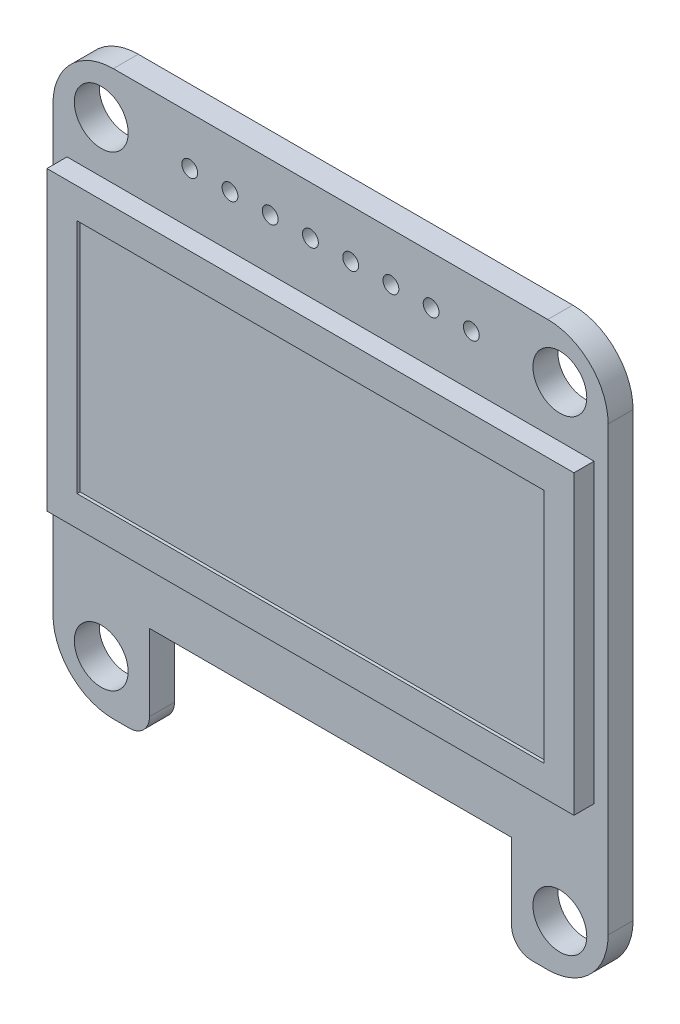
ISO-10303-21;
HEADER;
FILE_DESCRIPTION(('STEP AP214'),'2;1');
FILE_NAME('part.step','',(''),(''),'','','');
FILE_SCHEMA(('AUTOMOTIVE_DESIGN { 1 0 10303 214 1 1 1 1 }'));
ENDSEC;
DATA;
#1=APPLICATION_CONTEXT('core data for automotive mechanical design processes');
#2=APPLICATION_PROTOCOL_DEFINITION('international standard','automotive_design',2000,#1);
#3=PRODUCT_CONTEXT('',#1,'mechanical');
#4=PRODUCT('Part','Part','',(#3));
#5=PRODUCT_RELATED_PRODUCT_CATEGORY('part','',(#4));
#6=PRODUCT_DEFINITION_FORMATION('','',#4);
#7=PRODUCT_DEFINITION_CONTEXT('part definition',#1,'design');
#8=PRODUCT_DEFINITION('design','',#6,#7);
#9=PRODUCT_DEFINITION_SHAPE('','',#8);
#10=(LENGTH_UNIT() NAMED_UNIT(*) SI_UNIT(.MILLI.,.METRE.));
#11=(NAMED_UNIT(*) PLANE_ANGLE_UNIT() SI_UNIT($,.RADIAN.));
#12=(NAMED_UNIT(*) SI_UNIT($,.STERADIAN.) SOLID_ANGLE_UNIT());
#13=UNCERTAINTY_MEASURE_WITH_UNIT(LENGTH_MEASURE(1.E-05),#10,'distance_accuracy_value','');
#14=(GEOMETRIC_REPRESENTATION_CONTEXT(3) GLOBAL_UNCERTAINTY_ASSIGNED_CONTEXT((#13)) GLOBAL_UNIT_ASSIGNED_CONTEXT((#10,
#11,#12)) REPRESENTATION_CONTEXT('',''));
#15=CARTESIAN_POINT('',(0.,0.,0.));
#16=DIRECTION('',(0.,0.,1.));
#17=DIRECTION('',(1.,0.,0.));
#18=AXIS2_PLACEMENT_3D('',#15,#16,#17);
#19=CARTESIAN_POINT('',(-3.048,-3.048,1.5748));
#20=DIRECTION('',(0.,1.,0.));
#21=DIRECTION('',(0.,0.,1.));
#22=AXIS2_PLACEMENT_3D('',#19,#20,#21);
#23=PLANE('',#22);
#24=DIRECTION('',(1.,0.,0.));
#25=VECTOR('',#24,1.);
#26=CARTESIAN_POINT('',(-3.048,-3.048,0.));
#27=LINE('',#26,#25);
#28=CARTESIAN_POINT('',(0.762000000000003,-3.048,0.));
#29=VERTEX_POINT('',#28);
#30=CARTESIAN_POINT('',(1.778,-3.048,0.));
#31=VERTEX_POINT('',#30);
#32=EDGE_CURVE('E370',#29,#31,#27,.T.);
#33=ORIENTED_EDGE('',*,*,#32,.T.);
#34=DIRECTION('',(0.,0.,1.));
#35=VECTOR('',#34,1.);
#36=CARTESIAN_POINT('',(1.778,-3.048,1.5748));
#37=LINE('',#36,#35);
#38=CARTESIAN_POINT('',(1.778,-3.048,1.5748));
#39=VERTEX_POINT('',#38);
#40=EDGE_CURVE('E412',#31,#39,#37,.T.);
#41=ORIENTED_EDGE('',*,*,#40,.T.);
#42=DIRECTION('',(1.,0.,0.));
#43=VECTOR('',#42,1.);
#44=CARTESIAN_POINT('',(-3.048,-3.048,1.5748));
#45=LINE('',#44,#43);
#46=CARTESIAN_POINT('',(0.762000000000003,-3.048,1.5748));
#47=VERTEX_POINT('',#46);
#48=EDGE_CURVE('E357',#47,#39,#45,.T.);
#49=ORIENTED_EDGE('',*,*,#48,.F.);
#50=DIRECTION('',(0.,0.,-1.));
#51=VECTOR('',#50,1.);
#52=CARTESIAN_POINT('',(0.762000000000003,-3.048,1.5748));
#53=LINE('',#52,#51);
#54=EDGE_CURVE('E363',#47,#29,#53,.T.);
#55=ORIENTED_EDGE('',*,*,#54,.T.);
#56=EDGE_LOOP('',(#33,#41,#49,#55));
#57=FACE_BOUND('',#56,.T.);
#58=ADVANCED_FACE('F41',(#57),#23,.F.);
#59=CARTESIAN_POINT('',(-3.048,32.512,1.5748));
#60=DIRECTION('',(0.,1.,0.));
#61=DIRECTION('',(0.,0.,1.));
#62=AXIS2_PLACEMENT_3D('',#59,#60,#61);
#63=PLANE('',#62);
#64=DIRECTION('',(1.,0.,0.));
#65=VECTOR('',#64,1.);
#66=CARTESIAN_POINT('',(-3.048,32.512,1.5748));
#67=LINE('',#66,#65);
#68=CARTESIAN_POINT('',(0.762,32.512,1.5748));
#69=VERTEX_POINT('',#68);
#70=CARTESIAN_POINT('',(28.194,32.512,1.5748));
#71=VERTEX_POINT('',#70);
#72=EDGE_CURVE('E349',#69,#71,#67,.T.);
#73=ORIENTED_EDGE('',*,*,#72,.T.);
#74=DIRECTION('',(0.,0.,-1.));
#75=VECTOR('',#74,1.);
#76=CARTESIAN_POINT('',(28.194,32.512,1.5748));
#77=LINE('',#76,#75);
#78=CARTESIAN_POINT('',(28.194,32.512,0.));
#79=VERTEX_POINT('',#78);
#80=EDGE_CURVE('E409',#71,#79,#77,.T.);
#81=ORIENTED_EDGE('',*,*,#80,.T.);
#82=DIRECTION('',(1.,0.,0.));
#83=VECTOR('',#82,1.);
#84=CARTESIAN_POINT('',(-3.048,32.512,0.));
#85=LINE('',#84,#83);
#86=CARTESIAN_POINT('',(0.762,32.512,0.));
#87=VERTEX_POINT('',#86);
#88=EDGE_CURVE('E346',#87,#79,#85,.T.);
#89=ORIENTED_EDGE('',*,*,#88,.F.);
#90=DIRECTION('',(0.,0.,-1.));
#91=VECTOR('',#90,1.);
#92=CARTESIAN_POINT('',(0.762,32.512,1.5748));
#93=LINE('',#92,#91);
#94=EDGE_CURVE('E407',#87,#69,#93,.F.);
#95=ORIENTED_EDGE('',*,*,#94,.T.);
#96=EDGE_LOOP('',(#73,#81,#89,#95));
#97=FACE_BOUND('',#96,.T.);
#98=ADVANCED_FACE('F467',(#97),#63,.T.);
#99=CARTESIAN_POINT('',(-3.048,32.512,1.5748));
#100=DIRECTION('',(1.,0.,0.));
#101=DIRECTION('',(0.,1.,0.));
#102=AXIS2_PLACEMENT_3D('',#99,#100,#101);
#103=PLANE('',#102);
#104=DIRECTION('',(0.,-1.,0.));
#105=VECTOR('',#104,1.);
#106=CARTESIAN_POINT('',(-3.048,32.512,0.));
#107=LINE('',#106,#105);
#108=CARTESIAN_POINT('',(-3.048,28.702,0.));
#109=VERTEX_POINT('',#108);
#110=CARTESIAN_POINT('',(-3.048,0.762000000000006,0.));
#111=VERTEX_POINT('',#110);
#112=EDGE_CURVE('E353',#109,#111,#107,.T.);
#113=ORIENTED_EDGE('',*,*,#112,.T.);
#114=DIRECTION('',(0.,0.,-1.));
#115=VECTOR('',#114,1.);
#116=CARTESIAN_POINT('',(-3.048,0.762000000000006,1.5748));
#117=LINE('',#116,#115);
#118=CARTESIAN_POINT('',(-3.048,0.762000000000006,1.5748));
#119=VERTEX_POINT('',#118);
#120=EDGE_CURVE('E389',#111,#119,#117,.F.);
#121=ORIENTED_EDGE('',*,*,#120,.T.);
#122=DIRECTION('',(0.,-1.,0.));
#123=VECTOR('',#122,1.);
#124=CARTESIAN_POINT('',(-3.048,32.512,1.5748));
#125=LINE('',#124,#123);
#126=CARTESIAN_POINT('',(-3.048,28.702,1.5748));
#127=VERTEX_POINT('',#126);
#128=EDGE_CURVE('E360',#127,#119,#125,.T.);
#129=ORIENTED_EDGE('',*,*,#128,.F.);
#130=DIRECTION('',(0.,0.,-1.));
#131=VECTOR('',#130,1.);
#132=CARTESIAN_POINT('',(-3.048,28.702,0.));
#133=LINE('',#132,#131);
#134=EDGE_CURVE('E386',#127,#109,#133,.T.);
#135=ORIENTED_EDGE('',*,*,#134,.T.);
#136=EDGE_LOOP('',(#113,#121,#129,#135));
#137=FACE_BOUND('',#136,.T.);
#138=ADVANCED_FACE('F476',(#137),#103,.F.);
#139=CARTESIAN_POINT('',(27.178,-3.048,1.5748));
#140=VERTEX_POINT('',#139);
#141=CARTESIAN_POINT('',(28.194,-3.048,1.5748));
#142=VERTEX_POINT('',#141);
#143=EDGE_CURVE('E356',#140,#142,#45,.T.);
#144=ORIENTED_EDGE('',*,*,#143,.F.);
#145=DIRECTION('',(0.,0.,1.));
#146=VECTOR('',#145,1.);
#147=CARTESIAN_POINT('',(27.178,-3.048,1.5748));
#148=LINE('',#147,#146);
#149=CARTESIAN_POINT('',(27.178,-3.048,0.));
#150=VERTEX_POINT('',#149);
#151=EDGE_CURVE('E11',#140,#150,#148,.F.);
#152=ORIENTED_EDGE('',*,*,#151,.T.);
#153=CARTESIAN_POINT('',(28.194,-3.048,0.));
#154=VERTEX_POINT('',#153);
#155=EDGE_CURVE('E369',#150,#154,#27,.T.);
#156=ORIENTED_EDGE('',*,*,#155,.T.);
#157=DIRECTION('',(0.,0.,-1.));
#158=VECTOR('',#157,1.);
#159=CARTESIAN_POINT('',(28.194,-3.048,1.5748));
#160=LINE('',#159,#158);
#161=EDGE_CURVE('E404',#154,#142,#160,.F.);
#162=ORIENTED_EDGE('',*,*,#161,.T.);
#163=EDGE_LOOP('',(#144,#152,#156,#162));
#164=FACE_BOUND('',#163,.T.);
#165=ADVANCED_FACE('F449',(#164),#23,.F.);
#166=CARTESIAN_POINT('',(32.004,32.512,1.5748));
#167=DIRECTION('',(1.,0.,0.));
#168=DIRECTION('',(0.,0.,-1.));
#169=AXIS2_PLACEMENT_3D('',#166,#167,#168);
#170=PLANE('',#169);
#171=DIRECTION('',(0.,-1.,0.));
#172=VECTOR('',#171,1.);
#173=CARTESIAN_POINT('',(32.004,32.512,1.5748));
#174=LINE('',#173,#172);
#175=CARTESIAN_POINT('',(32.004,28.702,1.5748));
#176=VERTEX_POINT('',#175);
#177=CARTESIAN_POINT('',(32.004,0.762000000000006,1.5748));
#178=VERTEX_POINT('',#177);
#179=EDGE_CURVE('E352',#176,#178,#174,.T.);
#180=ORIENTED_EDGE('',*,*,#179,.T.);
#181=DIRECTION('',(0.,0.,-1.));
#182=VECTOR('',#181,1.);
#183=CARTESIAN_POINT('',(32.004,0.762000000000006,0.));
#184=LINE('',#183,#182);
#185=CARTESIAN_POINT('',(32.004,0.762000000000006,0.));
#186=VERTEX_POINT('',#185);
#187=EDGE_CURVE('E401',#178,#186,#184,.T.);
#188=ORIENTED_EDGE('',*,*,#187,.T.);
#189=DIRECTION('',(0.,-1.,0.));
#190=VECTOR('',#189,1.);
#191=CARTESIAN_POINT('',(32.004,32.512,0.));
#192=LINE('',#191,#190);
#193=CARTESIAN_POINT('',(32.004,28.702,0.));
#194=VERTEX_POINT('',#193);
#195=EDGE_CURVE('E366',#194,#186,#192,.T.);
#196=ORIENTED_EDGE('',*,*,#195,.F.);
#197=DIRECTION('',(0.,0.,-1.));
#198=VECTOR('',#197,1.);
#199=CARTESIAN_POINT('',(32.004,28.702,1.5748));
#200=LINE('',#199,#198);
#201=EDGE_CURVE('E399',#194,#176,#200,.F.);
#202=ORIENTED_EDGE('',*,*,#201,.T.);
#203=EDGE_LOOP('',(#180,#188,#196,#202));
#204=FACE_BOUND('',#203,.T.);
#205=ADVANCED_FACE('F457',(#204),#170,.T.);
#206=CARTESIAN_POINT('',(0.,0.,1.5748));
#207=DIRECTION('',(0.,0.,-1.));
#208=DIRECTION('',(-1.,0.,0.));
#209=AXIS2_PLACEMENT_3D('',#206,#207,#208);
#210=PLANE('',#209);
#211=DIRECTION('',(-1.,0.,0.));
#212=VECTOR('',#211,1.);
#213=CARTESIAN_POINT('',(31.115,26.2240568461912,1.5748));
#214=LINE('',#213,#212);
#215=CARTESIAN_POINT('',(31.115,26.2240568461912,1.5748));
#216=VERTEX_POINT('',#215);
#217=CARTESIAN_POINT('',(-2.15899999999999,26.2240568461912,1.5748));
#218=VERTEX_POINT('',#217);
#219=EDGE_CURVE('E234',#216,#218,#214,.T.);
#220=ORIENTED_EDGE('',*,*,#219,.F.);
#221=DIRECTION('',(0.,-1.,0.));
#222=VECTOR('',#221,1.);
#223=CARTESIAN_POINT('',(31.115,26.2240568461912,1.5748));
#224=LINE('',#223,#222);
#225=CARTESIAN_POINT('',(31.115,7.49300000000001,1.5748));
#226=VERTEX_POINT('',#225);
#227=EDGE_CURVE('E226',#216,#226,#224,.T.);
#228=ORIENTED_EDGE('',*,*,#227,.T.);
#229=DIRECTION('',(-1.,0.,0.));
#230=VECTOR('',#229,1.);
#231=CARTESIAN_POINT('',(31.115,7.49300000000001,1.5748));
#232=LINE('',#231,#230);
#233=CARTESIAN_POINT('',(-2.15899999999999,7.493,1.5748));
#234=VERTEX_POINT('',#233);
#235=EDGE_CURVE('E244',#226,#234,#232,.T.);
#236=ORIENTED_EDGE('',*,*,#235,.T.);
#237=DIRECTION('',(0.,-1.,0.));
#238=VECTOR('',#237,1.);
#239=CARTESIAN_POINT('',(-2.15899999999999,26.2240568461912,1.5748));
#240=LINE('',#239,#238);
#241=EDGE_CURVE('E64',#218,#234,#240,.T.);
#242=ORIENTED_EDGE('',*,*,#241,.F.);
#243=EDGE_LOOP('',(#220,#228,#236,#242));
#244=FACE_BOUND('',#243,.T.);
#245=CARTESIAN_POINT('',(5.58799999999999,29.464,1.5748));
#246=DIRECTION('',(0.,0.,1.));
#247=DIRECTION('',(1.,0.,0.));
#248=AXIS2_PLACEMENT_3D('',#245,#246,#247);
#249=CIRCLE('',#248,0.5);
#250=CARTESIAN_POINT('',(6.08799999999999,29.464,1.5748));
#251=VERTEX_POINT('',#250);
#252=EDGE_CURVE('E251',#251,#251,#249,.T.);
#253=ORIENTED_EDGE('',*,*,#252,.F.);
#254=EDGE_LOOP('',(#253));
#255=FACE_BOUND('',#254,.T.);
#256=CARTESIAN_POINT('',(8.12799999999999,29.464,1.5748));
#257=DIRECTION('',(0.,0.,1.));
#258=DIRECTION('',(1.,0.,0.));
#259=AXIS2_PLACEMENT_3D('',#256,#257,#258);
#260=CIRCLE('',#259,0.5);
#261=CARTESIAN_POINT('',(8.62799999999999,29.464,1.5748));
#262=VERTEX_POINT('',#261);
#263=EDGE_CURVE('E262',#262,#262,#260,.T.);
#264=ORIENTED_EDGE('',*,*,#263,.F.);
#265=EDGE_LOOP('',(#264));
#266=FACE_BOUND('',#265,.T.);
#267=CARTESIAN_POINT('',(10.668,29.464,1.5748));
#268=DIRECTION('',(0.,0.,1.));
#269=DIRECTION('',(1.,0.,0.));
#270=AXIS2_PLACEMENT_3D('',#267,#268,#269);
#271=CIRCLE('',#270,0.5);
#272=CARTESIAN_POINT('',(11.168,29.464,1.5748));
#273=VERTEX_POINT('',#272);
#274=EDGE_CURVE('E268',#273,#273,#271,.T.);
#275=ORIENTED_EDGE('',*,*,#274,.F.);
#276=EDGE_LOOP('',(#275));
#277=FACE_BOUND('',#276,.T.);
#278=CARTESIAN_POINT('',(13.208,29.464,1.5748));
#279=DIRECTION('',(0.,0.,1.));
#280=DIRECTION('',(1.,0.,0.));
#281=AXIS2_PLACEMENT_3D('',#278,#279,#280);
#282=CIRCLE('',#281,0.5);
#283=CARTESIAN_POINT('',(13.708,29.464,1.5748));
#284=VERTEX_POINT('',#283);
#285=EDGE_CURVE('E274',#284,#284,#282,.T.);
#286=ORIENTED_EDGE('',*,*,#285,.F.);
#287=EDGE_LOOP('',(#286));
#288=FACE_BOUND('',#287,.T.);
#289=CARTESIAN_POINT('',(15.748,29.464,1.5748));
#290=DIRECTION('',(0.,0.,1.));
#291=DIRECTION('',(1.,0.,0.));
#292=AXIS2_PLACEMENT_3D('',#289,#290,#291);
#293=CIRCLE('',#292,0.5);
#294=CARTESIAN_POINT('',(16.248,29.464,1.5748));
#295=VERTEX_POINT('',#294);
#296=EDGE_CURVE('E280',#295,#295,#293,.T.);
#297=ORIENTED_EDGE('',*,*,#296,.F.);
#298=EDGE_LOOP('',(#297));
#299=FACE_BOUND('',#298,.T.);
#300=CARTESIAN_POINT('',(18.288,29.464,1.5748));
#301=DIRECTION('',(0.,0.,1.));
#302=DIRECTION('',(1.,0.,0.));
#303=AXIS2_PLACEMENT_3D('',#300,#301,#302);
#304=CIRCLE('',#303,0.5);
#305=CARTESIAN_POINT('',(18.788,29.464,1.5748));
#306=VERTEX_POINT('',#305);
#307=EDGE_CURVE('E286',#306,#306,#304,.T.);
#308=ORIENTED_EDGE('',*,*,#307,.F.);
#309=EDGE_LOOP('',(#308));
#310=FACE_BOUND('',#309,.T.);
#311=CARTESIAN_POINT('',(20.828,29.464,1.5748));
#312=DIRECTION('',(0.,0.,1.));
#313=DIRECTION('',(1.,0.,0.));
#314=AXIS2_PLACEMENT_3D('',#311,#312,#313);
#315=CIRCLE('',#314,0.5);
#316=CARTESIAN_POINT('',(21.328,29.464,1.5748));
#317=VERTEX_POINT('',#316);
#318=EDGE_CURVE('E292',#317,#317,#315,.T.);
#319=ORIENTED_EDGE('',*,*,#318,.F.);
#320=EDGE_LOOP('',(#319));
#321=FACE_BOUND('',#320,.T.);
#322=CARTESIAN_POINT('',(23.368,29.464,1.5748));
#323=DIRECTION('',(0.,0.,1.));
#324=DIRECTION('',(1.,0.,0.));
#325=AXIS2_PLACEMENT_3D('',#322,#323,#324);
#326=CIRCLE('',#325,0.5);
#327=CARTESIAN_POINT('',(23.868,29.464,1.5748));
#328=VERTEX_POINT('',#327);
#329=EDGE_CURVE('E298',#328,#328,#326,.T.);
#330=ORIENTED_EDGE('',*,*,#329,.F.);
#331=EDGE_LOOP('',(#330));
#332=FACE_BOUND('',#331,.T.);
#333=CARTESIAN_POINT('',(0.,29.464,1.5748));
#334=DIRECTION('',(0.,0.,1.));
#335=DIRECTION('',(1.,0.,0.));
#336=AXIS2_PLACEMENT_3D('',#333,#334,#335);
#337=CIRCLE('',#336,1.69999999999999);
#338=CARTESIAN_POINT('',(1.69999999999999,29.464,1.5748));
#339=VERTEX_POINT('',#338);
#340=EDGE_CURVE('E304',#339,#339,#337,.T.);
#341=ORIENTED_EDGE('',*,*,#340,.F.);
#342=EDGE_LOOP('',(#341));
#343=FACE_BOUND('',#342,.T.);
#344=CARTESIAN_POINT('',(0.,0.,1.5748));
#345=DIRECTION('',(0.,0.,1.));
#346=DIRECTION('',(1.,0.,0.));
#347=AXIS2_PLACEMENT_3D('',#344,#345,#346);
#348=CIRCLE('',#347,1.69999999999999);
#349=CARTESIAN_POINT('',(1.69999999999999,0.,1.5748));
#350=VERTEX_POINT('',#349);
#351=EDGE_CURVE('E310',#350,#350,#348,.T.);
#352=ORIENTED_EDGE('',*,*,#351,.F.);
#353=EDGE_LOOP('',(#352));
#354=FACE_BOUND('',#353,.T.);
#355=CARTESIAN_POINT('',(28.956,0.,1.5748));
#356=DIRECTION('',(0.,0.,1.));
#357=DIRECTION('',(1.,0.,0.));
#358=AXIS2_PLACEMENT_3D('',#355,#356,#357);
#359=CIRCLE('',#358,1.69999999999999);
#360=CARTESIAN_POINT('',(30.656,0.,1.5748));
#361=VERTEX_POINT('',#360);
#362=EDGE_CURVE('E316',#361,#361,#359,.T.);
#363=ORIENTED_EDGE('',*,*,#362,.F.);
#364=EDGE_LOOP('',(#363));
#365=FACE_BOUND('',#364,.T.);
#366=CARTESIAN_POINT('',(28.956,29.464,1.5748));
#367=DIRECTION('',(0.,0.,1.));
#368=DIRECTION('',(1.,0.,0.));
#369=AXIS2_PLACEMENT_3D('',#366,#367,#368);
#370=CIRCLE('',#369,1.69999999999999);
#371=CARTESIAN_POINT('',(30.656,29.464,1.5748));
#372=VERTEX_POINT('',#371);
#373=EDGE_CURVE('E322',#372,#372,#370,.T.);
#374=ORIENTED_EDGE('',*,*,#373,.F.);
#375=EDGE_LOOP('',(#374));
#376=FACE_BOUND('',#375,.T.);
#377=ORIENTED_EDGE('',*,*,#48,.T.);
#378=CARTESIAN_POINT('',(1.778,-1.778,1.5748));
#379=DIRECTION('',(0.,0.,-1.));
#380=DIRECTION('',(-1.,0.,0.));
#381=AXIS2_PLACEMENT_3D('',#378,#379,#380);
#382=CIRCLE('',#381,1.27);
#383=CARTESIAN_POINT('',(3.048,-1.778,1.5748));
#384=VERTEX_POINT('',#383);
#385=EDGE_CURVE('E417',#39,#384,#382,.F.);
#386=ORIENTED_EDGE('',*,*,#385,.T.);
#387=DIRECTION('',(0.,1.,0.));
#388=VECTOR('',#387,1.);
#389=CARTESIAN_POINT('',(3.048,0.,1.5748));
#390=LINE('',#389,#388);
#391=CARTESIAN_POINT('',(3.048,3.048,1.5748));
#392=VERTEX_POINT('',#391);
#393=EDGE_CURVE('E332',#384,#392,#390,.T.);
#394=ORIENTED_EDGE('',*,*,#393,.T.);
#395=DIRECTION('',(1.,0.,0.));
#396=VECTOR('',#395,1.);
#397=CARTESIAN_POINT('',(0.,3.048,1.5748));
#398=LINE('',#397,#396);
#399=CARTESIAN_POINT('',(25.908,3.048,1.5748));
#400=VERTEX_POINT('',#399);
#401=EDGE_CURVE('E339',#392,#400,#398,.T.);
#402=ORIENTED_EDGE('',*,*,#401,.T.);
#403=DIRECTION('',(0.,1.,0.));
#404=VECTOR('',#403,1.);
#405=CARTESIAN_POINT('',(25.908,0.,1.5748));
#406=LINE('',#405,#404);
#407=CARTESIAN_POINT('',(25.908,-1.778,1.5748));
#408=VERTEX_POINT('',#407);
#409=EDGE_CURVE('E328',#408,#400,#406,.T.);
#410=ORIENTED_EDGE('',*,*,#409,.F.);
#411=CARTESIAN_POINT('',(27.178,-1.778,1.5748));
#412=DIRECTION('',(0.,0.,-1.));
#413=DIRECTION('',(-1.,0.,0.));
#414=AXIS2_PLACEMENT_3D('',#411,#412,#413);
#415=CIRCLE('',#414,1.27);
#416=EDGE_CURVE('E415',#408,#140,#415,.F.);
#417=ORIENTED_EDGE('',*,*,#416,.T.);
#418=ORIENTED_EDGE('',*,*,#143,.T.);
#419=CARTESIAN_POINT('',(28.194,0.762000000000006,1.5748));
#420=DIRECTION('',(0.,0.,-1.));
#421=DIRECTION('',(-1.,0.,0.));
#422=AXIS2_PLACEMENT_3D('',#419,#420,#421);
#423=CIRCLE('',#422,3.81);
#424=EDGE_CURVE('E395',#142,#178,#423,.F.);
#425=ORIENTED_EDGE('',*,*,#424,.T.);
#426=ORIENTED_EDGE('',*,*,#179,.F.);
#427=CARTESIAN_POINT('',(28.194,28.702,1.5748));
#428=DIRECTION('',(0.,0.,-1.));
#429=DIRECTION('',(-1.,0.,0.));
#430=AXIS2_PLACEMENT_3D('',#427,#428,#429);
#431=CIRCLE('',#430,3.81);
#432=EDGE_CURVE('E393',#176,#71,#431,.F.);
#433=ORIENTED_EDGE('',*,*,#432,.T.);
#434=ORIENTED_EDGE('',*,*,#72,.F.);
#435=CARTESIAN_POINT('',(0.762,28.702,1.5748));
#436=DIRECTION('',(0.,0.,-1.));
#437=DIRECTION('',(-1.,0.,0.));
#438=AXIS2_PLACEMENT_3D('',#435,#436,#437);
#439=CIRCLE('',#438,3.81);
#440=EDGE_CURVE('E391',#69,#127,#439,.F.);
#441=ORIENTED_EDGE('',*,*,#440,.T.);
#442=ORIENTED_EDGE('',*,*,#128,.T.);
#443=CARTESIAN_POINT('',(0.762000000000003,0.762000000000004,1.5748));
#444=DIRECTION('',(0.,0.,-1.));
#445=DIRECTION('',(-1.,0.,0.));
#446=AXIS2_PLACEMENT_3D('',#443,#444,#445);
#447=CIRCLE('',#446,3.81);
#448=EDGE_CURVE('E397',#119,#47,#447,.F.);
#449=ORIENTED_EDGE('',*,*,#448,.T.);
#450=EDGE_LOOP('',(#377,#386,#394,#402,#410,#417,#418,#425,#426,#433,#434,#441,#442,#449));
#451=FACE_BOUND('',#450,.T.);
#452=ADVANCED_FACE('F434',(#244,#255,#266,#277,#288,#299,#310,#321,#332,#343,#354,#365,#376,
#451),#210,.F.);
#453=CARTESIAN_POINT('',(0.,0.,0.));
#454=DIRECTION('',(0.,0.,-1.));
#455=DIRECTION('',(-1.,0.,0.));
#456=AXIS2_PLACEMENT_3D('',#453,#454,#455);
#457=PLANE('',#456);
#458=CARTESIAN_POINT('',(5.58799999999999,29.464,0.));
#459=DIRECTION('',(0.,0.,1.));
#460=DIRECTION('',(1.,0.,0.));
#461=AXIS2_PLACEMENT_3D('',#458,#459,#460);
#462=CIRCLE('',#461,0.5);
#463=CARTESIAN_POINT('',(6.08799999999999,29.464,0.));
#464=VERTEX_POINT('',#463);
#465=EDGE_CURVE('E259',#464,#464,#462,.T.);
#466=ORIENTED_EDGE('',*,*,#465,.T.);
#467=EDGE_LOOP('',(#466));
#468=FACE_BOUND('',#467,.T.);
#469=CARTESIAN_POINT('',(8.12799999999999,29.464,0.));
#470=DIRECTION('',(0.,0.,1.));
#471=DIRECTION('',(1.,0.,0.));
#472=AXIS2_PLACEMENT_3D('',#469,#470,#471);
#473=CIRCLE('',#472,0.5);
#474=CARTESIAN_POINT('',(8.62799999999999,29.464,0.));
#475=VERTEX_POINT('',#474);
#476=EDGE_CURVE('E265',#475,#475,#473,.T.);
#477=ORIENTED_EDGE('',*,*,#476,.T.);
#478=EDGE_LOOP('',(#477));
#479=FACE_BOUND('',#478,.T.);
#480=CARTESIAN_POINT('',(10.668,29.464,0.));
#481=DIRECTION('',(0.,0.,1.));
#482=DIRECTION('',(1.,0.,0.));
#483=AXIS2_PLACEMENT_3D('',#480,#481,#482);
#484=CIRCLE('',#483,0.5);
#485=CARTESIAN_POINT('',(11.168,29.464,0.));
#486=VERTEX_POINT('',#485);
#487=EDGE_CURVE('E271',#486,#486,#484,.T.);
#488=ORIENTED_EDGE('',*,*,#487,.T.);
#489=EDGE_LOOP('',(#488));
#490=FACE_BOUND('',#489,.T.);
#491=CARTESIAN_POINT('',(13.208,29.464,0.));
#492=DIRECTION('',(0.,0.,1.));
#493=DIRECTION('',(1.,0.,0.));
#494=AXIS2_PLACEMENT_3D('',#491,#492,#493);
#495=CIRCLE('',#494,0.5);
#496=CARTESIAN_POINT('',(13.708,29.464,0.));
#497=VERTEX_POINT('',#496);
#498=EDGE_CURVE('E277',#497,#497,#495,.T.);
#499=ORIENTED_EDGE('',*,*,#498,.T.);
#500=EDGE_LOOP('',(#499));
#501=FACE_BOUND('',#500,.T.);
#502=CARTESIAN_POINT('',(15.748,29.464,0.));
#503=DIRECTION('',(0.,0.,1.));
#504=DIRECTION('',(1.,0.,0.));
#505=AXIS2_PLACEMENT_3D('',#502,#503,#504);
#506=CIRCLE('',#505,0.5);
#507=CARTESIAN_POINT('',(16.248,29.464,0.));
#508=VERTEX_POINT('',#507);
#509=EDGE_CURVE('E283',#508,#508,#506,.T.);
#510=ORIENTED_EDGE('',*,*,#509,.T.);
#511=EDGE_LOOP('',(#510));
#512=FACE_BOUND('',#511,.T.);
#513=CARTESIAN_POINT('',(18.288,29.464,0.));
#514=DIRECTION('',(0.,0.,1.));
#515=DIRECTION('',(1.,0.,0.));
#516=AXIS2_PLACEMENT_3D('',#513,#514,#515);
#517=CIRCLE('',#516,0.5);
#518=CARTESIAN_POINT('',(18.788,29.464,0.));
#519=VERTEX_POINT('',#518);
#520=EDGE_CURVE('E289',#519,#519,#517,.T.);
#521=ORIENTED_EDGE('',*,*,#520,.T.);
#522=EDGE_LOOP('',(#521));
#523=FACE_BOUND('',#522,.T.);
#524=CARTESIAN_POINT('',(20.828,29.464,0.));
#525=DIRECTION('',(0.,0.,1.));
#526=DIRECTION('',(1.,0.,0.));
#527=AXIS2_PLACEMENT_3D('',#524,#525,#526);
#528=CIRCLE('',#527,0.5);
#529=CARTESIAN_POINT('',(21.328,29.464,0.));
#530=VERTEX_POINT('',#529);
#531=EDGE_CURVE('E295',#530,#530,#528,.T.);
#532=ORIENTED_EDGE('',*,*,#531,.T.);
#533=EDGE_LOOP('',(#532));
#534=FACE_BOUND('',#533,.T.);
#535=CARTESIAN_POINT('',(23.368,29.464,0.));
#536=DIRECTION('',(0.,0.,1.));
#537=DIRECTION('',(1.,0.,0.));
#538=AXIS2_PLACEMENT_3D('',#535,#536,#537);
#539=CIRCLE('',#538,0.5);
#540=CARTESIAN_POINT('',(23.868,29.464,0.));
#541=VERTEX_POINT('',#540);
#542=EDGE_CURVE('E301',#541,#541,#539,.T.);
#543=ORIENTED_EDGE('',*,*,#542,.T.);
#544=EDGE_LOOP('',(#543));
#545=FACE_BOUND('',#544,.T.);
#546=CARTESIAN_POINT('',(0.,29.464,0.));
#547=DIRECTION('',(0.,0.,1.));
#548=DIRECTION('',(1.,0.,0.));
#549=AXIS2_PLACEMENT_3D('',#546,#547,#548);
#550=CIRCLE('',#549,1.7);
#551=CARTESIAN_POINT('',(1.7,29.464,0.));
#552=VERTEX_POINT('',#551);
#553=EDGE_CURVE('E307',#552,#552,#550,.T.);
#554=ORIENTED_EDGE('',*,*,#553,.T.);
#555=EDGE_LOOP('',(#554));
#556=FACE_BOUND('',#555,.T.);
#557=CARTESIAN_POINT('',(0.,0.,0.));
#558=DIRECTION('',(0.,0.,1.));
#559=DIRECTION('',(1.,0.,0.));
#560=AXIS2_PLACEMENT_3D('',#557,#558,#559);
#561=CIRCLE('',#560,1.7);
#562=CARTESIAN_POINT('',(1.7,0.,0.));
#563=VERTEX_POINT('',#562);
#564=EDGE_CURVE('E313',#563,#563,#561,.T.);
#565=ORIENTED_EDGE('',*,*,#564,.T.);
#566=EDGE_LOOP('',(#565));
#567=FACE_BOUND('',#566,.T.);
#568=CARTESIAN_POINT('',(28.956,0.,0.));
#569=DIRECTION('',(0.,0.,1.));
#570=DIRECTION('',(1.,0.,0.));
#571=AXIS2_PLACEMENT_3D('',#568,#569,#570);
#572=CIRCLE('',#571,1.7);
#573=CARTESIAN_POINT('',(30.656,0.,0.));
#574=VERTEX_POINT('',#573);
#575=EDGE_CURVE('E319',#574,#574,#572,.T.);
#576=ORIENTED_EDGE('',*,*,#575,.T.);
#577=EDGE_LOOP('',(#576));
#578=FACE_BOUND('',#577,.T.);
#579=CARTESIAN_POINT('',(28.956,29.464,0.));
#580=DIRECTION('',(0.,0.,1.));
#581=DIRECTION('',(1.,0.,0.));
#582=AXIS2_PLACEMENT_3D('',#579,#580,#581);
#583=CIRCLE('',#582,1.7);
#584=CARTESIAN_POINT('',(30.656,29.464,0.));
#585=VERTEX_POINT('',#584);
#586=EDGE_CURVE('E325',#585,#585,#583,.T.);
#587=ORIENTED_EDGE('',*,*,#586,.T.);
#588=EDGE_LOOP('',(#587));
#589=FACE_BOUND('',#588,.T.);
#590=DIRECTION('',(0.,1.,0.));
#591=VECTOR('',#590,1.);
#592=CARTESIAN_POINT('',(3.048,0.,0.));
#593=LINE('',#592,#591);
#594=CARTESIAN_POINT('',(3.048,-1.778,0.));
#595=VERTEX_POINT('',#594);
#596=CARTESIAN_POINT('',(3.048,3.048,0.));
#597=VERTEX_POINT('',#596);
#598=EDGE_CURVE('E335',#595,#597,#593,.T.);
#599=ORIENTED_EDGE('',*,*,#598,.F.);
#600=CARTESIAN_POINT('',(1.778,-1.778,0.));
#601=DIRECTION('',(0.,0.,-1.));
#602=DIRECTION('',(-1.,0.,0.));
#603=AXIS2_PLACEMENT_3D('',#600,#601,#602);
#604=CIRCLE('',#603,1.27);
#605=EDGE_CURVE('E423',#595,#31,#604,.T.);
#606=ORIENTED_EDGE('',*,*,#605,.T.);
#607=ORIENTED_EDGE('',*,*,#32,.F.);
#608=CARTESIAN_POINT('',(0.762000000000003,0.762000000000004,0.));
#609=DIRECTION('',(0.,0.,-1.));
#610=DIRECTION('',(-1.,0.,0.));
#611=AXIS2_PLACEMENT_3D('',#608,#609,#610);
#612=CIRCLE('',#611,3.81);
#613=EDGE_CURVE('E384',#29,#111,#612,.T.);
#614=ORIENTED_EDGE('',*,*,#613,.T.);
#615=ORIENTED_EDGE('',*,*,#112,.F.);
#616=CARTESIAN_POINT('',(0.762,28.702,0.));
#617=DIRECTION('',(0.,0.,-1.));
#618=DIRECTION('',(-1.,0.,0.));
#619=AXIS2_PLACEMENT_3D('',#616,#617,#618);
#620=CIRCLE('',#619,3.81);
#621=EDGE_CURVE('E377',#109,#87,#620,.T.);
#622=ORIENTED_EDGE('',*,*,#621,.T.);
#623=ORIENTED_EDGE('',*,*,#88,.T.);
#624=CARTESIAN_POINT('',(28.194,28.702,0.));
#625=DIRECTION('',(0.,0.,-1.));
#626=DIRECTION('',(-1.,0.,0.));
#627=AXIS2_PLACEMENT_3D('',#624,#625,#626);
#628=CIRCLE('',#627,3.81);
#629=EDGE_CURVE('E379',#79,#194,#628,.T.);
#630=ORIENTED_EDGE('',*,*,#629,.T.);
#631=ORIENTED_EDGE('',*,*,#195,.T.);
#632=CARTESIAN_POINT('',(28.194,0.762000000000006,0.));
#633=DIRECTION('',(0.,0.,-1.));
#634=DIRECTION('',(-1.,0.,0.));
#635=AXIS2_PLACEMENT_3D('',#632,#633,#634);
#636=CIRCLE('',#635,3.81);
#637=EDGE_CURVE('E381',#186,#154,#636,.T.);
#638=ORIENTED_EDGE('',*,*,#637,.T.);
#639=ORIENTED_EDGE('',*,*,#155,.F.);
#640=CARTESIAN_POINT('',(27.178,-1.778,0.));
#641=DIRECTION('',(0.,0.,-1.));
#642=DIRECTION('',(-1.,0.,0.));
#643=AXIS2_PLACEMENT_3D('',#640,#641,#642);
#644=CIRCLE('',#643,1.27);
#645=CARTESIAN_POINT('',(25.908,-1.778,0.));
#646=VERTEX_POINT('',#645);
#647=EDGE_CURVE('E421',#150,#646,#644,.T.);
#648=ORIENTED_EDGE('',*,*,#647,.T.);
#649=DIRECTION('',(0.,1.,0.));
#650=VECTOR('',#649,1.);
#651=CARTESIAN_POINT('',(25.908,0.,0.));
#652=LINE('',#651,#650);
#653=CARTESIAN_POINT('',(25.908,3.048,0.));
#654=VERTEX_POINT('',#653);
#655=EDGE_CURVE('E329',#646,#654,#652,.T.);
#656=ORIENTED_EDGE('',*,*,#655,.T.);
#657=DIRECTION('',(1.,0.,0.));
#658=VECTOR('',#657,1.);
#659=CARTESIAN_POINT('',(0.,3.048,0.));
#660=LINE('',#659,#658);
#661=EDGE_CURVE('E331',#597,#654,#660,.T.);
#662=ORIENTED_EDGE('',*,*,#661,.F.);
#663=EDGE_LOOP('',(#599,#606,#607,#614,#615,#622,#623,#630,#631,#638,#639,#648,#656,#662));
#664=FACE_BOUND('',#663,.T.);
#665=ADVANCED_FACE('F444',(#468,#479,#490,#501,#512,#523,#534,#545,#556,#567,#578,#589,#664),
#457,.T.);
#666=CARTESIAN_POINT('',(25.908,0.,0.));
#667=DIRECTION('',(1.,0.,0.));
#668=DIRECTION('',(0.,0.,-1.));
#669=AXIS2_PLACEMENT_3D('',#666,#667,#668);
#670=PLANE('',#669);
#671=ORIENTED_EDGE('',*,*,#655,.F.);
#672=DIRECTION('',(0.,0.,1.));
#673=VECTOR('',#672,1.);
#674=CARTESIAN_POINT('',(25.908,-1.778,0.));
#675=LINE('',#674,#673);
#676=EDGE_CURVE('E49',#646,#408,#675,.T.);
#677=ORIENTED_EDGE('',*,*,#676,.T.);
#678=ORIENTED_EDGE('',*,*,#409,.T.);
#679=DIRECTION('',(0.,0.,1.));
#680=VECTOR('',#679,1.);
#681=CARTESIAN_POINT('',(25.908,3.048,0.));
#682=LINE('',#681,#680);
#683=EDGE_CURVE('E337',#654,#400,#682,.T.);
#684=ORIENTED_EDGE('',*,*,#683,.F.);
#685=EDGE_LOOP('',(#671,#677,#678,#684));
#686=FACE_BOUND('',#685,.T.);
#687=ADVANCED_FACE('F429',(#686),#670,.F.);
#688=CARTESIAN_POINT('',(3.048,0.,0.));
#689=DIRECTION('',(1.,0.,0.));
#690=DIRECTION('',(0.,0.,-1.));
#691=AXIS2_PLACEMENT_3D('',#688,#689,#690);
#692=PLANE('',#691);
#693=ORIENTED_EDGE('',*,*,#393,.F.);
#694=DIRECTION('',(0.,0.,1.));
#695=VECTOR('',#694,1.);
#696=CARTESIAN_POINT('',(3.048,-1.778,0.));
#697=LINE('',#696,#695);
#698=EDGE_CURVE('E419',#384,#595,#697,.F.);
#699=ORIENTED_EDGE('',*,*,#698,.T.);
#700=ORIENTED_EDGE('',*,*,#598,.T.);
#701=DIRECTION('',(0.,0.,1.));
#702=VECTOR('',#701,1.);
#703=CARTESIAN_POINT('',(3.048,3.048,0.));
#704=LINE('',#703,#702);
#705=EDGE_CURVE('E343',#597,#392,#704,.T.);
#706=ORIENTED_EDGE('',*,*,#705,.T.);
#707=EDGE_LOOP('',(#693,#699,#700,#706));
#708=FACE_BOUND('',#707,.T.);
#709=ADVANCED_FACE('F490',(#708),#692,.T.);
#710=CARTESIAN_POINT('',(0.,3.048,0.));
#711=DIRECTION('',(0.,-1.,0.));
#712=DIRECTION('',(0.,0.,-1.));
#713=AXIS2_PLACEMENT_3D('',#710,#711,#712);
#714=PLANE('',#713);
#715=ORIENTED_EDGE('',*,*,#401,.F.);
#716=ORIENTED_EDGE('',*,*,#705,.F.);
#717=ORIENTED_EDGE('',*,*,#661,.T.);
#718=ORIENTED_EDGE('',*,*,#683,.T.);
#719=EDGE_LOOP('',(#715,#716,#717,#718));
#720=FACE_BOUND('',#719,.T.);
#721=ADVANCED_FACE('F440',(#720),#714,.T.);
#722=CARTESIAN_POINT('',(28.956,29.464,1.5748));
#723=DIRECTION('',(0.,0.,1.));
#724=DIRECTION('',(1.,0.,0.));
#725=AXIS2_PLACEMENT_3D('',#722,#723,#724);
#726=CYLINDRICAL_SURFACE('',#725,1.69999999999999);
#727=ORIENTED_EDGE('',*,*,#586,.F.);
#728=EDGE_LOOP('',(#727));
#729=FACE_BOUND('',#728,.T.);
#730=ORIENTED_EDGE('',*,*,#373,.T.);
#731=EDGE_LOOP('',(#730));
#732=FACE_BOUND('',#731,.T.);
#733=ADVANCED_FACE('F497',(#729,#732),#726,.F.);
#734=CARTESIAN_POINT('',(28.956,0.,1.5748));
#735=DIRECTION('',(0.,0.,1.));
#736=DIRECTION('',(1.,0.,0.));
#737=AXIS2_PLACEMENT_3D('',#734,#735,#736);
#738=CYLINDRICAL_SURFACE('',#737,1.69999999999999);
#739=ORIENTED_EDGE('',*,*,#575,.F.);
#740=EDGE_LOOP('',(#739));
#741=FACE_BOUND('',#740,.T.);
#742=ORIENTED_EDGE('',*,*,#362,.T.);
#743=EDGE_LOOP('',(#742));
#744=FACE_BOUND('',#743,.T.);
#745=ADVANCED_FACE('F551',(#741,#744),#738,.F.);
#746=CARTESIAN_POINT('',(0.,0.,1.5748));
#747=DIRECTION('',(0.,0.,1.));
#748=DIRECTION('',(1.,0.,0.));
#749=AXIS2_PLACEMENT_3D('',#746,#747,#748);
#750=CYLINDRICAL_SURFACE('',#749,1.69999999999999);
#751=ORIENTED_EDGE('',*,*,#564,.F.);
#752=EDGE_LOOP('',(#751));
#753=FACE_BOUND('',#752,.T.);
#754=ORIENTED_EDGE('',*,*,#351,.T.);
#755=EDGE_LOOP('',(#754));
#756=FACE_BOUND('',#755,.T.);
#757=ADVANCED_FACE('F556',(#753,#756),#750,.F.);
#758=CARTESIAN_POINT('',(0.,29.464,1.5748));
#759=DIRECTION('',(0.,0.,1.));
#760=DIRECTION('',(1.,0.,0.));
#761=AXIS2_PLACEMENT_3D('',#758,#759,#760);
#762=CYLINDRICAL_SURFACE('',#761,1.69999999999999);
#763=ORIENTED_EDGE('',*,*,#553,.F.);
#764=EDGE_LOOP('',(#763));
#765=FACE_BOUND('',#764,.T.);
#766=ORIENTED_EDGE('',*,*,#340,.T.);
#767=EDGE_LOOP('',(#766));
#768=FACE_BOUND('',#767,.T.);
#769=ADVANCED_FACE('F563',(#765,#768),#762,.F.);
#770=CARTESIAN_POINT('',(23.368,29.464,1.5748));
#771=DIRECTION('',(0.,0.,1.));
#772=DIRECTION('',(1.,0.,0.));
#773=AXIS2_PLACEMENT_3D('',#770,#771,#772);
#774=CYLINDRICAL_SURFACE('',#773,0.5);
#775=ORIENTED_EDGE('',*,*,#542,.F.);
#776=EDGE_LOOP('',(#775));
#777=FACE_BOUND('',#776,.T.);
#778=ORIENTED_EDGE('',*,*,#329,.T.);
#779=EDGE_LOOP('',(#778));
#780=FACE_BOUND('',#779,.T.);
#781=ADVANCED_FACE('F567',(#777,#780),#774,.F.);
#782=CARTESIAN_POINT('',(20.828,29.464,1.5748));
#783=DIRECTION('',(0.,0.,1.));
#784=DIRECTION('',(1.,0.,0.));
#785=AXIS2_PLACEMENT_3D('',#782,#783,#784);
#786=CYLINDRICAL_SURFACE('',#785,0.5);
#787=ORIENTED_EDGE('',*,*,#531,.F.);
#788=EDGE_LOOP('',(#787));
#789=FACE_BOUND('',#788,.T.);
#790=ORIENTED_EDGE('',*,*,#318,.T.);
#791=EDGE_LOOP('',(#790));
#792=FACE_BOUND('',#791,.T.);
#793=ADVANCED_FACE('F571',(#789,#792),#786,.F.);
#794=CARTESIAN_POINT('',(18.288,29.464,1.5748));
#795=DIRECTION('',(0.,0.,1.));
#796=DIRECTION('',(1.,0.,0.));
#797=AXIS2_PLACEMENT_3D('',#794,#795,#796);
#798=CYLINDRICAL_SURFACE('',#797,0.5);
#799=ORIENTED_EDGE('',*,*,#520,.F.);
#800=EDGE_LOOP('',(#799));
#801=FACE_BOUND('',#800,.T.);
#802=ORIENTED_EDGE('',*,*,#307,.T.);
#803=EDGE_LOOP('',(#802));
#804=FACE_BOUND('',#803,.T.);
#805=ADVANCED_FACE('F575',(#801,#804),#798,.F.);
#806=CARTESIAN_POINT('',(15.748,29.464,1.5748));
#807=DIRECTION('',(0.,0.,1.));
#808=DIRECTION('',(1.,0.,0.));
#809=AXIS2_PLACEMENT_3D('',#806,#807,#808);
#810=CYLINDRICAL_SURFACE('',#809,0.5);
#811=ORIENTED_EDGE('',*,*,#509,.F.);
#812=EDGE_LOOP('',(#811));
#813=FACE_BOUND('',#812,.T.);
#814=ORIENTED_EDGE('',*,*,#296,.T.);
#815=EDGE_LOOP('',(#814));
#816=FACE_BOUND('',#815,.T.);
#817=ADVANCED_FACE('F579',(#813,#816),#810,.F.);
#818=CARTESIAN_POINT('',(13.208,29.464,1.5748));
#819=DIRECTION('',(0.,0.,1.));
#820=DIRECTION('',(1.,0.,0.));
#821=AXIS2_PLACEMENT_3D('',#818,#819,#820);
#822=CYLINDRICAL_SURFACE('',#821,0.5);
#823=ORIENTED_EDGE('',*,*,#498,.F.);
#824=EDGE_LOOP('',(#823));
#825=FACE_BOUND('',#824,.T.);
#826=ORIENTED_EDGE('',*,*,#285,.T.);
#827=EDGE_LOOP('',(#826));
#828=FACE_BOUND('',#827,.T.);
#829=ADVANCED_FACE('F583',(#825,#828),#822,.F.);
#830=CARTESIAN_POINT('',(10.668,29.464,1.5748));
#831=DIRECTION('',(0.,0.,1.));
#832=DIRECTION('',(1.,0.,0.));
#833=AXIS2_PLACEMENT_3D('',#830,#831,#832);
#834=CYLINDRICAL_SURFACE('',#833,0.5);
#835=ORIENTED_EDGE('',*,*,#487,.F.);
#836=EDGE_LOOP('',(#835));
#837=FACE_BOUND('',#836,.T.);
#838=ORIENTED_EDGE('',*,*,#274,.T.);
#839=EDGE_LOOP('',(#838));
#840=FACE_BOUND('',#839,.T.);
#841=ADVANCED_FACE('F587',(#837,#840),#834,.F.);
#842=CARTESIAN_POINT('',(8.12799999999999,29.464,1.5748));
#843=DIRECTION('',(0.,0.,1.));
#844=DIRECTION('',(1.,0.,0.));
#845=AXIS2_PLACEMENT_3D('',#842,#843,#844);
#846=CYLINDRICAL_SURFACE('',#845,0.5);
#847=ORIENTED_EDGE('',*,*,#476,.F.);
#848=EDGE_LOOP('',(#847));
#849=FACE_BOUND('',#848,.T.);
#850=ORIENTED_EDGE('',*,*,#263,.T.);
#851=EDGE_LOOP('',(#850));
#852=FACE_BOUND('',#851,.T.);
#853=ADVANCED_FACE('F591',(#849,#852),#846,.F.);
#854=CARTESIAN_POINT('',(5.58799999999999,29.464,1.5748));
#855=DIRECTION('',(0.,0.,1.));
#856=DIRECTION('',(1.,0.,0.));
#857=AXIS2_PLACEMENT_3D('',#854,#855,#856);
#858=CYLINDRICAL_SURFACE('',#857,0.5);
#859=ORIENTED_EDGE('',*,*,#465,.F.);
#860=EDGE_LOOP('',(#859));
#861=FACE_BOUND('',#860,.T.);
#862=ORIENTED_EDGE('',*,*,#252,.T.);
#863=EDGE_LOOP('',(#862));
#864=FACE_BOUND('',#863,.T.);
#865=ADVANCED_FACE('F595',(#861,#864),#858,.F.);
#866=CARTESIAN_POINT('',(0.762000000000003,0.762000000000004,1.5748));
#867=DIRECTION('',(0.,0.,-1.));
#868=DIRECTION('',(-1.,0.,0.));
#869=AXIS2_PLACEMENT_3D('',#866,#867,#868);
#870=CYLINDRICAL_SURFACE('',#869,3.81);
#871=ORIENTED_EDGE('',*,*,#448,.F.);
#872=ORIENTED_EDGE('',*,*,#120,.F.);
#873=ORIENTED_EDGE('',*,*,#613,.F.);
#874=ORIENTED_EDGE('',*,*,#54,.F.);
#875=EDGE_LOOP('',(#871,#872,#873,#874));
#876=FACE_BOUND('',#875,.T.);
#877=ADVANCED_FACE('F480',(#876),#870,.T.);
#878=CARTESIAN_POINT('',(28.194,0.762000000000006,1.5748));
#879=DIRECTION('',(0.,0.,1.));
#880=DIRECTION('',(1.,0.,0.));
#881=AXIS2_PLACEMENT_3D('',#878,#879,#880);
#882=CYLINDRICAL_SURFACE('',#881,3.81);
#883=ORIENTED_EDGE('',*,*,#424,.F.);
#884=ORIENTED_EDGE('',*,*,#161,.F.);
#885=ORIENTED_EDGE('',*,*,#637,.F.);
#886=ORIENTED_EDGE('',*,*,#187,.F.);
#887=EDGE_LOOP('',(#883,#884,#885,#886));
#888=FACE_BOUND('',#887,.T.);
#889=ADVANCED_FACE('F460',(#888),#882,.T.);
#890=CARTESIAN_POINT('',(28.194,28.702,1.5748));
#891=DIRECTION('',(0.,0.,-1.));
#892=DIRECTION('',(-1.,0.,0.));
#893=AXIS2_PLACEMENT_3D('',#890,#891,#892);
#894=CYLINDRICAL_SURFACE('',#893,3.81);
#895=ORIENTED_EDGE('',*,*,#432,.F.);
#896=ORIENTED_EDGE('',*,*,#201,.F.);
#897=ORIENTED_EDGE('',*,*,#629,.F.);
#898=ORIENTED_EDGE('',*,*,#80,.F.);
#899=EDGE_LOOP('',(#895,#896,#897,#898));
#900=FACE_BOUND('',#899,.T.);
#901=ADVANCED_FACE('F462',(#900),#894,.T.);
#902=CARTESIAN_POINT('',(0.762,28.702,1.5748));
#903=DIRECTION('',(0.,0.,1.));
#904=DIRECTION('',(1.,0.,0.));
#905=AXIS2_PLACEMENT_3D('',#902,#903,#904);
#906=CYLINDRICAL_SURFACE('',#905,3.81);
#907=ORIENTED_EDGE('',*,*,#440,.F.);
#908=ORIENTED_EDGE('',*,*,#94,.F.);
#909=ORIENTED_EDGE('',*,*,#621,.F.);
#910=ORIENTED_EDGE('',*,*,#134,.F.);
#911=EDGE_LOOP('',(#907,#908,#909,#910));
#912=FACE_BOUND('',#911,.T.);
#913=ADVANCED_FACE('F471',(#912),#906,.T.);
#914=CARTESIAN_POINT('',(1.778,-1.778,1.5748));
#915=DIRECTION('',(0.,0.,-1.));
#916=DIRECTION('',(-1.,0.,0.));
#917=AXIS2_PLACEMENT_3D('',#914,#915,#916);
#918=CYLINDRICAL_SURFACE('',#917,1.27);
#919=ORIENTED_EDGE('',*,*,#605,.F.);
#920=ORIENTED_EDGE('',*,*,#698,.F.);
#921=ORIENTED_EDGE('',*,*,#385,.F.);
#922=ORIENTED_EDGE('',*,*,#40,.F.);
#923=EDGE_LOOP('',(#919,#920,#921,#922));
#924=FACE_BOUND('',#923,.T.);
#925=ADVANCED_FACE('F487',(#924),#918,.T.);
#926=CARTESIAN_POINT('',(27.178,-1.778,0.));
#927=DIRECTION('',(0.,0.,1.));
#928=DIRECTION('',(1.,0.,0.));
#929=AXIS2_PLACEMENT_3D('',#926,#927,#928);
#930=CYLINDRICAL_SURFACE('',#929,1.27);
#931=ORIENTED_EDGE('',*,*,#647,.F.);
#932=ORIENTED_EDGE('',*,*,#151,.F.);
#933=ORIENTED_EDGE('',*,*,#416,.F.);
#934=ORIENTED_EDGE('',*,*,#676,.F.);
#935=EDGE_LOOP('',(#931,#932,#933,#934));
#936=FACE_BOUND('',#935,.T.);
#937=ADVANCED_FACE('F43',(#936),#930,.T.);
#938=CARTESIAN_POINT('',(31.115,26.2240568461912,2.8448));
#939=DIRECTION('',(1.,0.,0.));
#940=DIRECTION('',(0.,0.,-1.));
#941=AXIS2_PLACEMENT_3D('',#938,#939,#940);
#942=PLANE('',#941);
#943=ORIENTED_EDGE('',*,*,#227,.F.);
#944=DIRECTION('',(0.,0.,-1.));
#945=VECTOR('',#944,1.);
#946=CARTESIAN_POINT('',(31.115,26.2240568461912,2.8448));
#947=LINE('',#946,#945);
#948=CARTESIAN_POINT('',(31.115,26.2240568461912,2.8448));
#949=VERTEX_POINT('',#948);
#950=EDGE_CURVE('E249',#949,#216,#947,.T.);
#951=ORIENTED_EDGE('',*,*,#950,.F.);
#952=DIRECTION('',(0.,-1.,0.));
#953=VECTOR('',#952,1.);
#954=CARTESIAN_POINT('',(31.115,26.2240568461912,2.8448));
#955=LINE('',#954,#953);
#956=CARTESIAN_POINT('',(31.115,7.49300000000001,2.8448));
#957=VERTEX_POINT('',#956);
#958=EDGE_CURVE('E230',#949,#957,#955,.T.);
#959=ORIENTED_EDGE('',*,*,#958,.T.);
#960=DIRECTION('',(0.,0.,-1.));
#961=VECTOR('',#960,1.);
#962=CARTESIAN_POINT('',(31.115,7.49300000000001,2.8448));
#963=LINE('',#962,#961);
#964=EDGE_CURVE('E241',#957,#226,#963,.T.);
#965=ORIENTED_EDGE('',*,*,#964,.T.);
#966=EDGE_LOOP('',(#943,#951,#959,#965));
#967=FACE_BOUND('',#966,.T.);
#968=ADVANCED_FACE('F600',(#967),#942,.T.);
#969=CARTESIAN_POINT('',(31.115,26.2240568461912,2.8448));
#970=DIRECTION('',(0.,-1.,0.));
#971=DIRECTION('',(0.,0.,-1.));
#972=AXIS2_PLACEMENT_3D('',#969,#970,#971);
#973=PLANE('',#972);
#974=ORIENTED_EDGE('',*,*,#219,.T.);
#975=DIRECTION('',(0.,0.,-1.));
#976=VECTOR('',#975,1.);
#977=CARTESIAN_POINT('',(-2.15899999999999,26.2240568461912,2.8448));
#978=LINE('',#977,#976);
#979=CARTESIAN_POINT('',(-2.15899999999999,26.2240568461912,2.8448));
#980=VERTEX_POINT('',#979);
#981=EDGE_CURVE('E252',#980,#218,#978,.T.);
#982=ORIENTED_EDGE('',*,*,#981,.F.);
#983=DIRECTION('',(-1.,0.,0.));
#984=VECTOR('',#983,1.);
#985=CARTESIAN_POINT('',(31.115,26.2240568461912,2.8448));
#986=LINE('',#985,#984);
#987=EDGE_CURVE('E239',#949,#980,#986,.T.);
#988=ORIENTED_EDGE('',*,*,#987,.F.);
#989=ORIENTED_EDGE('',*,*,#950,.T.);
#990=EDGE_LOOP('',(#974,#982,#988,#989));
#991=FACE_BOUND('',#990,.T.);
#992=ADVANCED_FACE('F603',(#991),#973,.F.);
#993=CARTESIAN_POINT('',(-2.15899999999999,26.2240568461912,2.8448));
#994=DIRECTION('',(1.,0.,0.));
#995=DIRECTION('',(0.,1.,0.));
#996=AXIS2_PLACEMENT_3D('',#993,#994,#995);
#997=PLANE('',#996);
#998=ORIENTED_EDGE('',*,*,#241,.T.);
#999=DIRECTION('',(0.,0.,-1.));
#1000=VECTOR('',#999,1.);
#1001=CARTESIAN_POINT('',(-2.15899999999999,7.493,2.8448));
#1002=LINE('',#1001,#1000);
#1003=CARTESIAN_POINT('',(-2.15899999999999,7.493,2.8448));
#1004=VERTEX_POINT('',#1003);
#1005=EDGE_CURVE('E254',#1004,#234,#1002,.T.);
#1006=ORIENTED_EDGE('',*,*,#1005,.F.);
#1007=DIRECTION('',(0.,-1.,0.));
#1008=VECTOR('',#1007,1.);
#1009=CARTESIAN_POINT('',(-2.15899999999999,26.2240568461912,2.8448));
#1010=LINE('',#1009,#1008);
#1011=EDGE_CURVE('E237',#980,#1004,#1010,.T.);
#1012=ORIENTED_EDGE('',*,*,#1011,.F.);
#1013=ORIENTED_EDGE('',*,*,#981,.T.);
#1014=EDGE_LOOP('',(#998,#1006,#1012,#1013));
#1015=FACE_BOUND('',#1014,.T.);
#1016=ADVANCED_FACE('F609',(#1015),#997,.F.);
#1017=CARTESIAN_POINT('',(31.115,7.49300000000001,2.8448));
#1018=DIRECTION('',(0.,-1.,0.));
#1019=DIRECTION('',(1.,0.,0.));
#1020=AXIS2_PLACEMENT_3D('',#1017,#1018,#1019);
#1021=PLANE('',#1020);
#1022=ORIENTED_EDGE('',*,*,#235,.F.);
#1023=ORIENTED_EDGE('',*,*,#964,.F.);
#1024=DIRECTION('',(-1.,0.,0.));
#1025=VECTOR('',#1024,1.);
#1026=CARTESIAN_POINT('',(31.115,7.49300000000001,2.8448));
#1027=LINE('',#1026,#1025);
#1028=EDGE_CURVE('E233',#957,#1004,#1027,.T.);
#1029=ORIENTED_EDGE('',*,*,#1028,.T.);
#1030=ORIENTED_EDGE('',*,*,#1005,.T.);
#1031=EDGE_LOOP('',(#1022,#1023,#1029,#1030));
#1032=FACE_BOUND('',#1031,.T.);
#1033=ADVANCED_FACE('F605',(#1032),#1021,.T.);
#1034=CARTESIAN_POINT('',(0.,0.,2.8448));
#1035=DIRECTION('',(0.,0.,-1.));
#1036=DIRECTION('',(-1.,0.,0.));
#1037=AXIS2_PLACEMENT_3D('',#1034,#1035,#1036);
#1038=PLANE('',#1037);
#1039=DIRECTION('',(1.,0.,0.));
#1040=VECTOR('',#1039,1.);
#1041=CARTESIAN_POINT('',(-0.253999999999994,9.39800000000001,2.8448));
#1042=LINE('',#1041,#1040);
#1043=CARTESIAN_POINT('',(-0.253999999999994,9.39800000000001,2.8448));
#1044=VERTEX_POINT('',#1043);
#1045=CARTESIAN_POINT('',(29.21,9.39800000000001,2.8448));
#1046=VERTEX_POINT('',#1045);
#1047=EDGE_CURVE('E220',#1044,#1046,#1042,.T.);
#1048=ORIENTED_EDGE('',*,*,#1047,.F.);
#1049=DIRECTION('',(0.,-1.,0.));
#1050=VECTOR('',#1049,1.);
#1051=CARTESIAN_POINT('',(-0.253999999999994,24.3190568461912,2.8448));
#1052=LINE('',#1051,#1050);
#1053=CARTESIAN_POINT('',(-0.253999999999994,24.3190568461912,2.8448));
#1054=VERTEX_POINT('',#1053);
#1055=EDGE_CURVE('E56',#1054,#1044,#1052,.T.);
#1056=ORIENTED_EDGE('',*,*,#1055,.F.);
#1057=DIRECTION('',(-1.,0.,0.));
#1058=VECTOR('',#1057,1.);
#1059=CARTESIAN_POINT('',(-0.253999999999994,24.3190568461912,2.8448));
#1060=LINE('',#1059,#1058);
#1061=CARTESIAN_POINT('',(29.21,24.3190568461912,2.8448));
#1062=VERTEX_POINT('',#1061);
#1063=EDGE_CURVE('E211',#1062,#1054,#1060,.T.);
#1064=ORIENTED_EDGE('',*,*,#1063,.F.);
#1065=DIRECTION('',(0.,1.,0.));
#1066=VECTOR('',#1065,1.);
#1067=CARTESIAN_POINT('',(29.21,24.3190568461912,2.8448));
#1068=LINE('',#1067,#1066);
#1069=EDGE_CURVE('E214',#1046,#1062,#1068,.T.);
#1070=ORIENTED_EDGE('',*,*,#1069,.F.);
#1071=EDGE_LOOP('',(#1048,#1056,#1064,#1070));
#1072=FACE_BOUND('',#1071,.T.);
#1073=ORIENTED_EDGE('',*,*,#958,.F.);
#1074=ORIENTED_EDGE('',*,*,#987,.T.);
#1075=ORIENTED_EDGE('',*,*,#1011,.T.);
#1076=ORIENTED_EDGE('',*,*,#1028,.F.);
#1077=EDGE_LOOP('',(#1073,#1074,#1075,#1076));
#1078=FACE_BOUND('',#1077,.T.);
#1079=ADVANCED_FACE('F608',(#1072,#1078),#1038,.F.);
#1080=CARTESIAN_POINT('',(-0.253999999999994,24.3190568461912,2.6543));
#1081=DIRECTION('',(-1.,0.,0.));
#1082=DIRECTION('',(0.,0.,1.));
#1083=AXIS2_PLACEMENT_3D('',#1080,#1081,#1082);
#1084=PLANE('',#1083);
#1085=ORIENTED_EDGE('',*,*,#1055,.T.);
#1086=DIRECTION('',(0.,0.,1.));
#1087=VECTOR('',#1086,1.);
#1088=CARTESIAN_POINT('',(-0.253999999999994,9.39800000000001,2.6543));
#1089=LINE('',#1088,#1087);
#1090=CARTESIAN_POINT('',(-0.253999999999994,9.39800000000001,2.6543));
#1091=VERTEX_POINT('',#1090);
#1092=EDGE_CURVE('E189',#1091,#1044,#1089,.T.);
#1093=ORIENTED_EDGE('',*,*,#1092,.F.);
#1094=DIRECTION('',(0.,-1.,0.));
#1095=VECTOR('',#1094,1.);
#1096=CARTESIAN_POINT('',(-0.253999999999994,24.3190568461912,2.6543));
#1097=LINE('',#1096,#1095);
#1098=CARTESIAN_POINT('',(-0.253999999999994,24.3190568461912,2.6543));
#1099=VERTEX_POINT('',#1098);
#1100=EDGE_CURVE('E193',#1099,#1091,#1097,.T.);
#1101=ORIENTED_EDGE('',*,*,#1100,.F.);
#1102=DIRECTION('',(0.,0.,1.));
#1103=VECTOR('',#1102,1.);
#1104=CARTESIAN_POINT('',(-0.253999999999994,24.3190568461912,2.6543));
#1105=LINE('',#1104,#1103);
#1106=EDGE_CURVE('E224',#1099,#1054,#1105,.T.);
#1107=ORIENTED_EDGE('',*,*,#1106,.T.);
#1108=EDGE_LOOP('',(#1085,#1093,#1101,#1107));
#1109=FACE_BOUND('',#1108,.T.);
#1110=ADVANCED_FACE('F191',(#1109),#1084,.F.);
#1111=CARTESIAN_POINT('',(-0.253999999999994,24.3190568461912,2.6543));
#1112=DIRECTION('',(0.,1.,0.));
#1113=DIRECTION('',(0.,0.,1.));
#1114=AXIS2_PLACEMENT_3D('',#1111,#1112,#1113);
#1115=PLANE('',#1114);
#1116=ORIENTED_EDGE('',*,*,#1063,.T.);
#1117=ORIENTED_EDGE('',*,*,#1106,.F.);
#1118=DIRECTION('',(-1.,0.,0.));
#1119=VECTOR('',#1118,1.);
#1120=CARTESIAN_POINT('',(-0.253999999999994,24.3190568461912,2.6543));
#1121=LINE('',#1120,#1119);
#1122=CARTESIAN_POINT('',(29.21,24.3190568461912,2.6543));
#1123=VERTEX_POINT('',#1122);
#1124=EDGE_CURVE('E199',#1123,#1099,#1121,.T.);
#1125=ORIENTED_EDGE('',*,*,#1124,.F.);
#1126=DIRECTION('',(0.,0.,1.));
#1127=VECTOR('',#1126,1.);
#1128=CARTESIAN_POINT('',(29.21,24.3190568461912,2.6543));
#1129=LINE('',#1128,#1127);
#1130=EDGE_CURVE('E227',#1123,#1062,#1129,.T.);
#1131=ORIENTED_EDGE('',*,*,#1130,.T.);
#1132=EDGE_LOOP('',(#1116,#1117,#1125,#1131));
#1133=FACE_BOUND('',#1132,.T.);
#1134=ADVANCED_FACE('F621',(#1133),#1115,.F.);
#1135=CARTESIAN_POINT('',(29.21,24.3190568461912,2.6543));
#1136=DIRECTION('',(1.,0.,0.));
#1137=DIRECTION('',(0.,0.,-1.));
#1138=AXIS2_PLACEMENT_3D('',#1135,#1136,#1137);
#1139=PLANE('',#1138);
#1140=ORIENTED_EDGE('',*,*,#1069,.T.);
#1141=ORIENTED_EDGE('',*,*,#1130,.F.);
#1142=DIRECTION('',(0.,1.,0.));
#1143=VECTOR('',#1142,1.);
#1144=CARTESIAN_POINT('',(29.21,24.3190568461912,2.6543));
#1145=LINE('',#1144,#1143);
#1146=CARTESIAN_POINT('',(29.21,9.39800000000001,2.6543));
#1147=VERTEX_POINT('',#1146);
#1148=EDGE_CURVE('E207',#1147,#1123,#1145,.T.);
#1149=ORIENTED_EDGE('',*,*,#1148,.F.);
#1150=DIRECTION('',(0.,0.,1.));
#1151=VECTOR('',#1150,1.);
#1152=CARTESIAN_POINT('',(29.21,9.39800000000001,2.6543));
#1153=LINE('',#1152,#1151);
#1154=EDGE_CURVE('E198',#1147,#1046,#1153,.T.);
#1155=ORIENTED_EDGE('',*,*,#1154,.T.);
#1156=EDGE_LOOP('',(#1140,#1141,#1149,#1155));
#1157=FACE_BOUND('',#1156,.T.);
#1158=ADVANCED_FACE('F624',(#1157),#1139,.F.);
#1159=CARTESIAN_POINT('',(-0.253999999999994,9.39800000000001,2.6543));
#1160=DIRECTION('',(0.,-1.,0.));
#1161=DIRECTION('',(0.,0.,-1.));
#1162=AXIS2_PLACEMENT_3D('',#1159,#1160,#1161);
#1163=PLANE('',#1162);
#1164=ORIENTED_EDGE('',*,*,#1047,.T.);
#1165=ORIENTED_EDGE('',*,*,#1154,.F.);
#1166=DIRECTION('',(1.,0.,0.));
#1167=VECTOR('',#1166,1.);
#1168=CARTESIAN_POINT('',(-0.253999999999994,9.39800000000001,2.6543));
#1169=LINE('',#1168,#1167);
#1170=EDGE_CURVE('E202',#1091,#1147,#1169,.T.);
#1171=ORIENTED_EDGE('',*,*,#1170,.F.);
#1172=ORIENTED_EDGE('',*,*,#1092,.T.);
#1173=EDGE_LOOP('',(#1164,#1165,#1171,#1172));
#1174=FACE_BOUND('',#1173,.T.);
#1175=ADVANCED_FACE('F203',(#1174),#1163,.F.);
#1176=CARTESIAN_POINT('',(0.,0.,2.6543));
#1177=DIRECTION('',(0.,0.,1.));
#1178=DIRECTION('',(1.,0.,0.));
#1179=AXIS2_PLACEMENT_3D('',#1176,#1177,#1178);
#1180=PLANE('',#1179);
#1181=ORIENTED_EDGE('',*,*,#1100,.T.);
#1182=ORIENTED_EDGE('',*,*,#1170,.T.);
#1183=ORIENTED_EDGE('',*,*,#1148,.T.);
#1184=ORIENTED_EDGE('',*,*,#1124,.T.);
#1185=EDGE_LOOP('',(#1181,#1182,#1183,#1184));
#1186=FACE_BOUND('',#1185,.T.);
#1187=ADVANCED_FACE('F209',(#1186),#1180,.T.);
#1188=CLOSED_SHELL('',(#58,#98,#138,#165,#205,#452,#665,#687,#709,#721,#733,#745,#757,#769,#781,
#793,#805,#817,#829,#841,#853,#865,#877,#889,#901,#913,#925,#937,#968,#992,#1016,#1033,#1079,
#1110,#1134,#1158,#1175,#1187));
#1189=MANIFOLD_SOLID_BREP('B2',#1188);
#1190=ADVANCED_BREP_SHAPE_REPRESENTATION('',(#18,#1189),#14);
#1191=SHAPE_DEFINITION_REPRESENTATION(#9,#1190);
ENDSEC;
END-ISO-10303-21;
